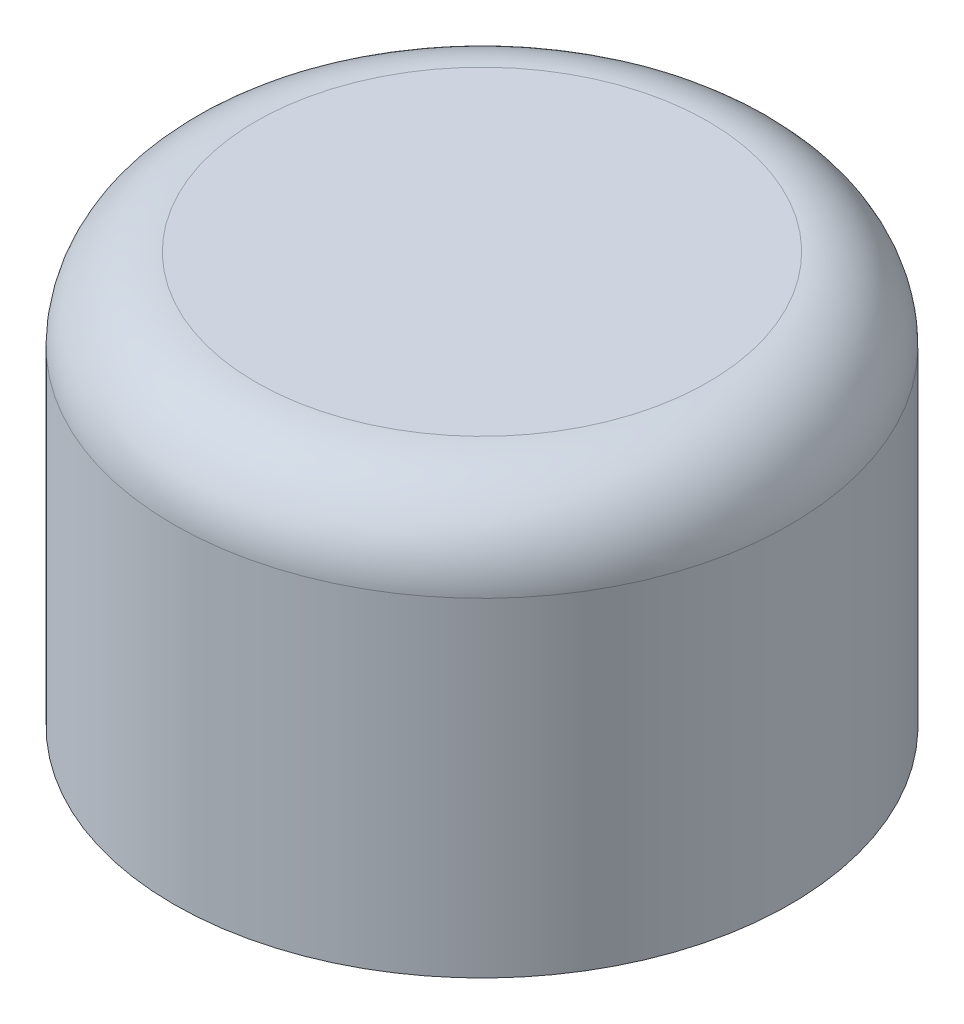
ISO-10303-21;
HEADER;
FILE_DESCRIPTION(('STEP AP214'),'2;1');
FILE_NAME('part.step','',(''),(''),'','','');
FILE_SCHEMA(('AUTOMOTIVE_DESIGN { 1 0 10303 214 1 1 1 1 }'));
ENDSEC;
DATA;
#1=APPLICATION_CONTEXT('core data for automotive mechanical design processes');
#2=APPLICATION_PROTOCOL_DEFINITION('international standard','automotive_design',2000,#1);
#3=PRODUCT_CONTEXT('',#1,'mechanical');
#4=PRODUCT('Part','Part','',(#3));
#5=PRODUCT_RELATED_PRODUCT_CATEGORY('part','',(#4));
#6=PRODUCT_DEFINITION_FORMATION('','',#4);
#7=PRODUCT_DEFINITION_CONTEXT('part definition',#1,'design');
#8=PRODUCT_DEFINITION('design','',#6,#7);
#9=PRODUCT_DEFINITION_SHAPE('','',#8);
#10=(LENGTH_UNIT() NAMED_UNIT(*) SI_UNIT(.MILLI.,.METRE.));
#11=(NAMED_UNIT(*) PLANE_ANGLE_UNIT() SI_UNIT($,.RADIAN.));
#12=(NAMED_UNIT(*) SI_UNIT($,.STERADIAN.) SOLID_ANGLE_UNIT());
#13=UNCERTAINTY_MEASURE_WITH_UNIT(LENGTH_MEASURE(1.E-05),#10,'distance_accuracy_value','');
#14=(GEOMETRIC_REPRESENTATION_CONTEXT(3) GLOBAL_UNCERTAINTY_ASSIGNED_CONTEXT((#13)) GLOBAL_UNIT_ASSIGNED_CONTEXT((#10,
#11,#12)) REPRESENTATION_CONTEXT('',''));
#15=CARTESIAN_POINT('',(0.,0.,0.));
#16=DIRECTION('',(0.,0.,1.));
#17=DIRECTION('',(1.,0.,0.));
#18=AXIS2_PLACEMENT_3D('',#15,#16,#17);
#19=CARTESIAN_POINT('',(0.,20.,0.));
#20=DIRECTION('',(0.,-1.,0.));
#21=DIRECTION('',(0.,0.,-1.));
#22=AXIS2_PLACEMENT_3D('',#19,#20,#21);
#23=CYLINDRICAL_SURFACE('',#22,15.);
#24=CARTESIAN_POINT('',(0.,16.,0.));
#25=DIRECTION('',(0.,1.,0.));
#26=DIRECTION('',(0.,0.,1.));
#27=AXIS2_PLACEMENT_3D('',#24,#25,#26);
#28=CIRCLE('',#27,15.);
#29=CARTESIAN_POINT('',(0.,16.,15.));
#30=VERTEX_POINT('',#29);
#31=EDGE_CURVE('E11',#30,#30,#28,.F.);
#32=ORIENTED_EDGE('',*,*,#31,.T.);
#33=EDGE_LOOP('',(#32));
#34=FACE_BOUND('',#33,.T.);
#35=CARTESIAN_POINT('',(0.,0.,0.));
#36=DIRECTION('',(0.,1.,0.));
#37=DIRECTION('',(0.,0.,1.));
#38=AXIS2_PLACEMENT_3D('',#35,#36,#37);
#39=CIRCLE('',#38,15.);
#40=CARTESIAN_POINT('',(0.,0.,15.));
#41=VERTEX_POINT('',#40);
#42=EDGE_CURVE('E60',#41,#41,#39,.T.);
#43=ORIENTED_EDGE('',*,*,#42,.T.);
#44=EDGE_LOOP('',(#43));
#45=FACE_BOUND('',#44,.T.);
#46=ADVANCED_FACE('F38',(#34,#45),#23,.T.);
#47=CARTESIAN_POINT('',(0.,20.,0.));
#48=DIRECTION('',(0.,1.,0.));
#49=DIRECTION('',(0.,0.,1.));
#50=AXIS2_PLACEMENT_3D('',#47,#48,#49);
#51=PLANE('',#50);
#52=CARTESIAN_POINT('',(0.,20.,0.));
#53=DIRECTION('',(0.,1.,0.));
#54=DIRECTION('',(0.,0.,1.));
#55=AXIS2_PLACEMENT_3D('',#52,#53,#54);
#56=CIRCLE('',#55,11.);
#57=CARTESIAN_POINT('',(0.,20.,11.));
#58=VERTEX_POINT('',#57);
#59=EDGE_CURVE('E46',#58,#58,#56,.T.);
#60=ORIENTED_EDGE('',*,*,#59,.T.);
#61=EDGE_LOOP('',(#60));
#62=FACE_BOUND('',#61,.T.);
#63=ADVANCED_FACE('F75',(#62),#51,.T.);
#64=CARTESIAN_POINT('',(0.,0.,0.));
#65=DIRECTION('',(0.,1.,0.));
#66=DIRECTION('',(0.,0.,1.));
#67=AXIS2_PLACEMENT_3D('',#64,#65,#66);
#68=PLANE('',#67);
#69=CARTESIAN_POINT('',(0.,0.,0.));
#70=DIRECTION('',(0.,-1.,0.));
#71=DIRECTION('',(0.,0.,-1.));
#72=AXIS2_PLACEMENT_3D('',#69,#70,#71);
#73=CIRCLE('',#72,7.74999999999999);
#74=CARTESIAN_POINT('',(0.,0.,-7.74999999999999));
#75=VERTEX_POINT('',#74);
#76=EDGE_CURVE('E61',#75,#75,#73,.T.);
#77=ORIENTED_EDGE('',*,*,#76,.F.);
#78=EDGE_LOOP('',(#77));
#79=FACE_BOUND('',#78,.T.);
#80=ORIENTED_EDGE('',*,*,#42,.F.);
#81=EDGE_LOOP('',(#80));
#82=FACE_BOUND('',#81,.T.);
#83=ADVANCED_FACE('F53',(#79,#82),#68,.F.);
#84=CARTESIAN_POINT('',(0.,15.,0.));
#85=DIRECTION('',(0.,-1.,0.));
#86=DIRECTION('',(0.,0.,-1.));
#87=AXIS2_PLACEMENT_3D('',#84,#85,#86);
#88=CONICAL_SURFACE('',#87,7.75,1.02974425867665);
#89=CARTESIAN_POINT('',(0.,19.6566697974636,0.));
#90=VERTEX_POINT('',#89);
#91=VERTEX_LOOP('',#90);
#92=FACE_BOUND('',#91,.T.);
#93=CARTESIAN_POINT('',(0.,15.,0.));
#94=DIRECTION('',(0.,-1.,0.));
#95=DIRECTION('',(0.,0.,-1.));
#96=AXIS2_PLACEMENT_3D('',#93,#94,#95);
#97=CIRCLE('',#96,7.75);
#98=CARTESIAN_POINT('',(0.,15.,-7.75));
#99=VERTEX_POINT('',#98);
#100=EDGE_CURVE('E57',#99,#99,#97,.T.);
#101=ORIENTED_EDGE('',*,*,#100,.T.);
#102=EDGE_LOOP('',(#101));
#103=FACE_BOUND('',#102,.T.);
#104=ADVANCED_FACE('F49',(#92,#103),#88,.F.);
#105=CARTESIAN_POINT('',(0.,0.,0.));
#106=DIRECTION('',(0.,-1.,0.));
#107=DIRECTION('',(0.,0.,-1.));
#108=AXIS2_PLACEMENT_3D('',#105,#106,#107);
#109=CYLINDRICAL_SURFACE('',#108,7.74999999999999);
#110=ORIENTED_EDGE('',*,*,#100,.F.);
#111=EDGE_LOOP('',(#110));
#112=FACE_BOUND('',#111,.T.);
#113=ORIENTED_EDGE('',*,*,#76,.T.);
#114=EDGE_LOOP('',(#113));
#115=FACE_BOUND('',#114,.T.);
#116=ADVANCED_FACE('F52',(#112,#115),#109,.F.);
#117=CARTESIAN_POINT('',(0.,16.,0.));
#118=DIRECTION('',(0.,1.,0.));
#119=DIRECTION('',(0.,0.,1.));
#120=AXIS2_PLACEMENT_3D('',#117,#118,#119);
#121=TOROIDAL_SURFACE('',#120,11.,4.);
#122=ORIENTED_EDGE('',*,*,#31,.F.);
#123=EDGE_LOOP('',(#122));
#124=FACE_BOUND('',#123,.T.);
#125=ORIENTED_EDGE('',*,*,#59,.F.);
#126=EDGE_LOOP('',(#125));
#127=FACE_BOUND('',#126,.T.);
#128=ADVANCED_FACE('F40',(#124,#127),#121,.T.);
#129=CLOSED_SHELL('',(#46,#63,#83,#104,#116,#128));
#130=MANIFOLD_SOLID_BREP('B2',#129);
#131=ADVANCED_BREP_SHAPE_REPRESENTATION('',(#18,#130),#14);
#132=SHAPE_DEFINITION_REPRESENTATION(#9,#131);
ENDSEC;
END-ISO-10303-21;
